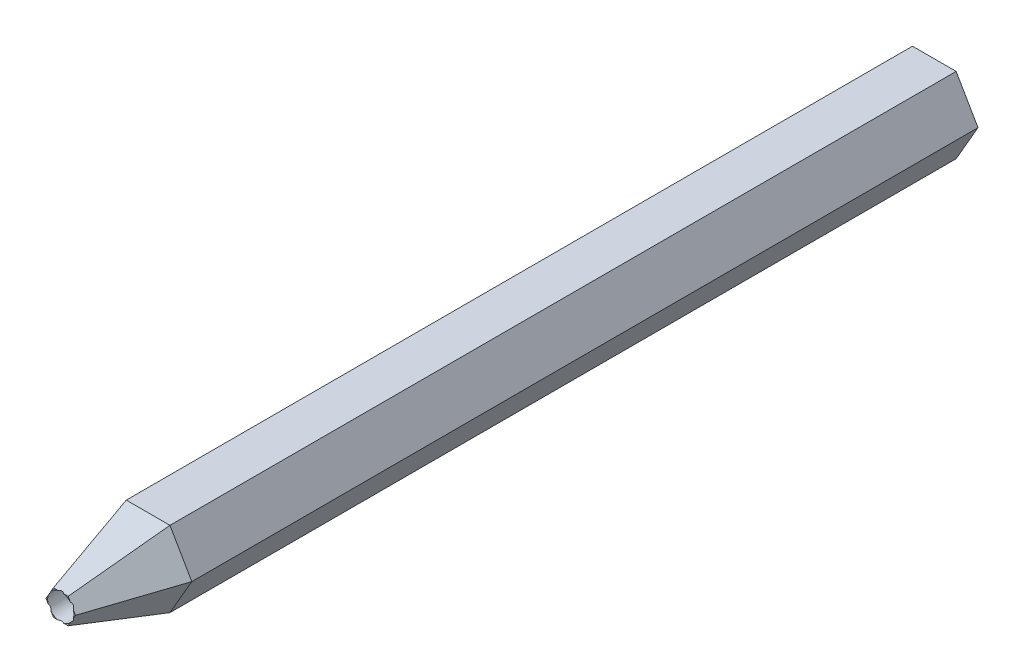
ISO-10303-21;
HEADER;
FILE_DESCRIPTION(('STEP AP214'),'2;1');
FILE_NAME('part.step','',(''),(''),'','','');
FILE_SCHEMA(('AUTOMOTIVE_DESIGN { 1 0 10303 214 1 1 1 1 }'));
ENDSEC;
DATA;
#1=APPLICATION_CONTEXT('core data for automotive mechanical design processes');
#2=APPLICATION_PROTOCOL_DEFINITION('international standard','automotive_design',2000,#1);
#3=PRODUCT_CONTEXT('',#1,'mechanical');
#4=PRODUCT('Part','Part','',(#3));
#5=PRODUCT_RELATED_PRODUCT_CATEGORY('part','',(#4));
#6=PRODUCT_DEFINITION_FORMATION('','',#4);
#7=PRODUCT_DEFINITION_CONTEXT('part definition',#1,'design');
#8=PRODUCT_DEFINITION('design','',#6,#7);
#9=PRODUCT_DEFINITION_SHAPE('','',#8);
#10=(LENGTH_UNIT() NAMED_UNIT(*) SI_UNIT(.MILLI.,.METRE.));
#11=(NAMED_UNIT(*) PLANE_ANGLE_UNIT() SI_UNIT($,.RADIAN.));
#12=(NAMED_UNIT(*) SI_UNIT($,.STERADIAN.) SOLID_ANGLE_UNIT());
#13=UNCERTAINTY_MEASURE_WITH_UNIT(LENGTH_MEASURE(1.E-05),#10,'distance_accuracy_value','');
#14=(GEOMETRIC_REPRESENTATION_CONTEXT(3) GLOBAL_UNCERTAINTY_ASSIGNED_CONTEXT((#13)) GLOBAL_UNIT_ASSIGNED_CONTEXT((#10,
#11,#12)) REPRESENTATION_CONTEXT('',''));
#15=CARTESIAN_POINT('',(0.,0.,0.));
#16=DIRECTION('',(0.,0.,1.));
#17=DIRECTION('',(1.,0.,0.));
#18=AXIS2_PLACEMENT_3D('',#15,#16,#17);
#19=CARTESIAN_POINT('',(7.49999999999999,-4.33012701892219,100.));
#20=DIRECTION('',(0.,0.,1.));
#21=DIRECTION('',(1.,0.,0.));
#22=AXIS2_PLACEMENT_3D('',#19,#20,#21);
#23=PLANE('',#22);
#24=CARTESIAN_POINT('',(0.,0.,100.));
#25=DIRECTION('',(0.,0.,1.));
#26=DIRECTION('',(1.,0.,0.));
#27=AXIS2_PLACEMENT_3D('',#24,#25,#26);
#28=CIRCLE('',#27,1.5);
#29=CARTESIAN_POINT('',(1.10043882872506,1.01933036069482,100.));
#30=VERTEX_POINT('',#29);
#31=CARTESIAN_POINT('',(0.33254657284792,1.4626731613341,100.));
#32=VERTEX_POINT('',#31);
#33=EDGE_CURVE('E149',#30,#32,#28,.T.);
#34=ORIENTED_EDGE('',*,*,#33,.F.);
#35=DIRECTION('',(-0.5,0.866025403784439,0.));
#36=VECTOR('',#35,1.);
#37=CARTESIAN_POINT('',(0.0167121151490251,2.89640009012815,100.));
#38=LINE('',#37,#36);
#39=CARTESIAN_POINT('',(0.844474743432681,1.46267316133411,100.));
#40=VERTEX_POINT('',#39);
#41=EDGE_CURVE('E158',#30,#40,#38,.T.);
#42=ORIENTED_EDGE('',*,*,#41,.T.);
#43=DIRECTION('',(-1.,0.,0.));
#44=VECTOR('',#43,1.);
#45=CARTESIAN_POINT('',(-2.5,1.4626731613341,100.));
#46=LINE('',#45,#44);
#47=EDGE_CURVE('E166',#40,#32,#46,.T.);
#48=ORIENTED_EDGE('',*,*,#47,.T.);
#49=EDGE_LOOP('',(#34,#42,#48));
#50=FACE_BOUND('',#49,.T.);
#51=ADVANCED_FACE('F31',(#50),#23,.T.);
#52=CARTESIAN_POINT('',(-0.332546572847921,1.4626731613341,100.));
#53=VERTEX_POINT('',#52);
#54=CARTESIAN_POINT('',(-1.10043882872507,1.0193303606948,100.));
#55=VERTEX_POINT('',#54);
#56=EDGE_CURVE('E280',#53,#55,#28,.T.);
#57=ORIENTED_EDGE('',*,*,#56,.F.);
#58=CARTESIAN_POINT('',(-0.844474743432688,1.4626731613341,100.));
#59=VERTEX_POINT('',#58);
#60=EDGE_CURVE('E164',#53,#59,#46,.T.);
#61=ORIENTED_EDGE('',*,*,#60,.T.);
#62=DIRECTION('',(-0.5,-0.866025403784439,0.));
#63=VECTOR('',#62,1.);
#64=CARTESIAN_POINT('',(-2.51671211514903,-1.43372692879404,100.));
#65=LINE('',#64,#63);
#66=EDGE_CURVE('E174',#59,#55,#65,.T.);
#67=ORIENTED_EDGE('',*,*,#66,.T.);
#68=EDGE_LOOP('',(#57,#61,#67));
#69=FACE_BOUND('',#68,.T.);
#70=ADVANCED_FACE('F323',(#69),#23,.T.);
#71=CARTESIAN_POINT('',(-1.43298540157299,0.443342800639305,100.));
#72=VERTEX_POINT('',#71);
#73=CARTESIAN_POINT('',(-1.43298540157299,-0.443342800639308,100.));
#74=VERTEX_POINT('',#73);
#75=EDGE_CURVE('E45',#72,#74,#28,.T.);
#76=ORIENTED_EDGE('',*,*,#75,.F.);
#77=CARTESIAN_POINT('',(-1.68894948686537,0.,100.));
#78=VERTEX_POINT('',#77);
#79=EDGE_CURVE('E173',#72,#78,#65,.T.);
#80=ORIENTED_EDGE('',*,*,#79,.T.);
#81=DIRECTION('',(0.5,-0.866025403784439,0.));
#82=VECTOR('',#81,1.);
#83=CARTESIAN_POINT('',(-0.0167121151490314,-2.89640009012815,100.));
#84=LINE('',#83,#82);
#85=EDGE_CURVE('E178',#78,#74,#84,.T.);
#86=ORIENTED_EDGE('',*,*,#85,.T.);
#87=EDGE_LOOP('',(#76,#80,#86));
#88=FACE_BOUND('',#87,.T.);
#89=ADVANCED_FACE('F287',(#88),#23,.T.);
#90=CARTESIAN_POINT('',(-1.10043882872507,-1.0193303606948,100.));
#91=VERTEX_POINT('',#90);
#92=CARTESIAN_POINT('',(-0.332546572847922,-1.4626731613341,100.));
#93=VERTEX_POINT('',#92);
#94=EDGE_CURVE('E284',#91,#93,#28,.T.);
#95=ORIENTED_EDGE('',*,*,#94,.F.);
#96=CARTESIAN_POINT('',(-0.844474743432688,-1.4626731613341,100.));
#97=VERTEX_POINT('',#96);
#98=EDGE_CURVE('E177',#91,#97,#84,.T.);
#99=ORIENTED_EDGE('',*,*,#98,.T.);
#100=DIRECTION('',(1.,0.,0.));
#101=VECTOR('',#100,1.);
#102=CARTESIAN_POINT('',(2.5,-1.4626731613341,100.));
#103=LINE('',#102,#101);
#104=EDGE_CURVE('E222',#97,#93,#103,.T.);
#105=ORIENTED_EDGE('',*,*,#104,.T.);
#106=EDGE_LOOP('',(#95,#99,#105));
#107=FACE_BOUND('',#106,.T.);
#108=ADVANCED_FACE('F285',(#107),#23,.T.);
#109=CARTESIAN_POINT('',(0.332546572847923,-1.4626731613341,100.));
#110=VERTEX_POINT('',#109);
#111=CARTESIAN_POINT('',(1.10043882872507,-1.01933036069481,100.));
#112=VERTEX_POINT('',#111);
#113=EDGE_CURVE('E147',#110,#112,#28,.T.);
#114=ORIENTED_EDGE('',*,*,#113,.F.);
#115=CARTESIAN_POINT('',(0.844474743432685,-1.4626731613341,100.));
#116=VERTEX_POINT('',#115);
#117=EDGE_CURVE('E259',#110,#116,#103,.T.);
#118=ORIENTED_EDGE('',*,*,#117,.T.);
#119=DIRECTION('',(0.5,0.866025403784439,0.));
#120=VECTOR('',#119,1.);
#121=CARTESIAN_POINT('',(2.51671211514902,1.43372692879404,100.));
#122=LINE('',#121,#120);
#123=EDGE_CURVE('E168',#116,#112,#122,.T.);
#124=ORIENTED_EDGE('',*,*,#123,.T.);
#125=EDGE_LOOP('',(#114,#118,#124));
#126=FACE_BOUND('',#125,.T.);
#127=ADVANCED_FACE('F267',(#126),#23,.T.);
#128=CARTESIAN_POINT('',(-2.5,-4.33012701892219,100.));
#129=DIRECTION('',(0.,1.,0.));
#130=DIRECTION('',(-1.,0.,0.));
#131=AXIS2_PLACEMENT_3D('',#128,#129,#130);
#132=PLANE('',#131);
#133=DIRECTION('',(0.,0.,-1.));
#134=VECTOR('',#133,1.);
#135=CARTESIAN_POINT('',(2.5,-4.33012701892219,100.));
#136=LINE('',#135,#134);
#137=CARTESIAN_POINT('',(2.5,-4.33012701892219,89.9999999999999));
#138=VERTEX_POINT('',#137);
#139=CARTESIAN_POINT('',(2.5,-4.33012701892219,0.));
#140=VERTEX_POINT('',#139);
#141=EDGE_CURVE('E196',#138,#140,#136,.T.);
#142=ORIENTED_EDGE('',*,*,#141,.F.);
#143=DIRECTION('',(-1.,0.,0.));
#144=VECTOR('',#143,1.);
#145=CARTESIAN_POINT('',(-2.5,-4.33012701892219,89.9999999999999));
#146=LINE('',#145,#144);
#147=CARTESIAN_POINT('',(-2.5,-4.33012701892219,89.9999999999999));
#148=VERTEX_POINT('',#147);
#149=EDGE_CURVE('E39',#138,#148,#146,.T.);
#150=ORIENTED_EDGE('',*,*,#149,.T.);
#151=DIRECTION('',(0.,0.,-1.));
#152=VECTOR('',#151,1.);
#153=CARTESIAN_POINT('',(-2.5,-4.33012701892219,100.));
#154=LINE('',#153,#152);
#155=CARTESIAN_POINT('',(-2.5,-4.33012701892219,0.));
#156=VERTEX_POINT('',#155);
#157=EDGE_CURVE('E194',#148,#156,#154,.T.);
#158=ORIENTED_EDGE('',*,*,#157,.T.);
#159=DIRECTION('',(1.,0.,0.));
#160=VECTOR('',#159,1.);
#161=CARTESIAN_POINT('',(-2.5,-4.33012701892219,0.));
#162=LINE('',#161,#160);
#163=EDGE_CURVE('E237',#156,#140,#162,.T.);
#164=ORIENTED_EDGE('',*,*,#163,.T.);
#165=EDGE_LOOP('',(#142,#150,#158,#164));
#166=FACE_BOUND('',#165,.T.);
#167=ADVANCED_FACE('F33',(#166),#132,.F.);
#168=CARTESIAN_POINT('',(2.5,-4.33012701892219,100.));
#169=DIRECTION('',(-0.866025403784439,0.5,0.));
#170=DIRECTION('',(-0.5,-0.866025403784439,0.));
#171=AXIS2_PLACEMENT_3D('',#168,#169,#170);
#172=PLANE('',#171);
#173=DIRECTION('',(0.,0.,-1.));
#174=VECTOR('',#173,1.);
#175=CARTESIAN_POINT('',(5.,0.,100.));
#176=LINE('',#175,#174);
#177=CARTESIAN_POINT('',(5.,0.,89.9999999999999));
#178=VERTEX_POINT('',#177);
#179=CARTESIAN_POINT('',(5.,0.,0.));
#180=VERTEX_POINT('',#179);
#181=EDGE_CURVE('E257',#178,#180,#176,.T.);
#182=ORIENTED_EDGE('',*,*,#181,.F.);
#183=DIRECTION('',(-0.5,-0.866025403784439,0.));
#184=VECTOR('',#183,1.);
#185=CARTESIAN_POINT('',(2.5,-4.33012701892219,89.9999999999999));
#186=LINE('',#185,#184);
#187=EDGE_CURVE('E53',#178,#138,#186,.T.);
#188=ORIENTED_EDGE('',*,*,#187,.T.);
#189=ORIENTED_EDGE('',*,*,#141,.T.);
#190=DIRECTION('',(0.5,0.866025403784439,0.));
#191=VECTOR('',#190,1.);
#192=CARTESIAN_POINT('',(2.5,-4.33012701892219,0.));
#193=LINE('',#192,#191);
#194=EDGE_CURVE('E239',#140,#180,#193,.T.);
#195=ORIENTED_EDGE('',*,*,#194,.T.);
#196=EDGE_LOOP('',(#182,#188,#189,#195));
#197=FACE_BOUND('',#196,.T.);
#198=ADVANCED_FACE('F309',(#197),#172,.F.);
#199=CARTESIAN_POINT('',(5.,0.,100.));
#200=DIRECTION('',(-0.866025403784439,-0.5,0.));
#201=DIRECTION('',(0.5,-0.866025403784439,0.));
#202=AXIS2_PLACEMENT_3D('',#199,#200,#201);
#203=PLANE('',#202);
#204=DIRECTION('',(0.,0.,-1.));
#205=VECTOR('',#204,1.);
#206=CARTESIAN_POINT('',(2.5,4.33012701892219,100.));
#207=LINE('',#206,#205);
#208=CARTESIAN_POINT('',(2.5,4.33012701892219,89.9999999999999));
#209=VERTEX_POINT('',#208);
#210=CARTESIAN_POINT('',(2.5,4.33012701892219,0.));
#211=VERTEX_POINT('',#210);
#212=EDGE_CURVE('E255',#209,#211,#207,.T.);
#213=ORIENTED_EDGE('',*,*,#212,.F.);
#214=DIRECTION('',(0.5,-0.866025403784439,0.));
#215=VECTOR('',#214,1.);
#216=CARTESIAN_POINT('',(5.,0.,89.9999999999999));
#217=LINE('',#216,#215);
#218=EDGE_CURVE('E188',#209,#178,#217,.T.);
#219=ORIENTED_EDGE('',*,*,#218,.T.);
#220=ORIENTED_EDGE('',*,*,#181,.T.);
#221=DIRECTION('',(-0.5,0.866025403784439,0.));
#222=VECTOR('',#221,1.);
#223=CARTESIAN_POINT('',(5.,0.,0.));
#224=LINE('',#223,#222);
#225=EDGE_CURVE('E242',#180,#211,#224,.T.);
#226=ORIENTED_EDGE('',*,*,#225,.T.);
#227=EDGE_LOOP('',(#213,#219,#220,#226));
#228=FACE_BOUND('',#227,.T.);
#229=ADVANCED_FACE('F308',(#228),#203,.F.);
#230=CARTESIAN_POINT('',(2.5,4.33012701892219,100.));
#231=DIRECTION('',(0.,-1.,0.));
#232=DIRECTION('',(1.,0.,0.));
#233=AXIS2_PLACEMENT_3D('',#230,#231,#232);
#234=PLANE('',#233);
#235=DIRECTION('',(0.,0.,-1.));
#236=VECTOR('',#235,1.);
#237=CARTESIAN_POINT('',(-2.5,4.33012701892219,100.));
#238=LINE('',#237,#236);
#239=CARTESIAN_POINT('',(-2.5,4.33012701892219,89.9999999999999));
#240=VERTEX_POINT('',#239);
#241=CARTESIAN_POINT('',(-2.5,4.33012701892219,0.));
#242=VERTEX_POINT('',#241);
#243=EDGE_CURVE('E253',#240,#242,#238,.T.);
#244=ORIENTED_EDGE('',*,*,#243,.F.);
#245=DIRECTION('',(1.,0.,0.));
#246=VECTOR('',#245,1.);
#247=CARTESIAN_POINT('',(2.5,4.33012701892219,89.9999999999999));
#248=LINE('',#247,#246);
#249=EDGE_CURVE('E186',#240,#209,#248,.T.);
#250=ORIENTED_EDGE('',*,*,#249,.T.);
#251=ORIENTED_EDGE('',*,*,#212,.T.);
#252=DIRECTION('',(-1.,0.,0.));
#253=VECTOR('',#252,1.);
#254=CARTESIAN_POINT('',(2.5,4.33012701892219,0.));
#255=LINE('',#254,#253);
#256=EDGE_CURVE('E245',#211,#242,#255,.T.);
#257=ORIENTED_EDGE('',*,*,#256,.T.);
#258=EDGE_LOOP('',(#244,#250,#251,#257));
#259=FACE_BOUND('',#258,.T.);
#260=ADVANCED_FACE('F298',(#259),#234,.F.);
#261=CARTESIAN_POINT('',(-2.5,4.33012701892219,100.));
#262=DIRECTION('',(0.866025403784439,-0.5,0.));
#263=DIRECTION('',(0.5,0.866025403784439,0.));
#264=AXIS2_PLACEMENT_3D('',#261,#262,#263);
#265=PLANE('',#264);
#266=DIRECTION('',(0.,0.,-1.));
#267=VECTOR('',#266,1.);
#268=CARTESIAN_POINT('',(-5.,0.,100.));
#269=LINE('',#268,#267);
#270=CARTESIAN_POINT('',(-5.,0.,89.9999999999999));
#271=VERTEX_POINT('',#270);
#272=CARTESIAN_POINT('',(-5.,0.,0.));
#273=VERTEX_POINT('',#272);
#274=EDGE_CURVE('E208',#271,#273,#269,.T.);
#275=ORIENTED_EDGE('',*,*,#274,.F.);
#276=DIRECTION('',(0.5,0.866025403784439,0.));
#277=VECTOR('',#276,1.);
#278=CARTESIAN_POINT('',(-2.5,4.33012701892219,89.9999999999999));
#279=LINE('',#278,#277);
#280=EDGE_CURVE('E184',#271,#240,#279,.T.);
#281=ORIENTED_EDGE('',*,*,#280,.T.);
#282=ORIENTED_EDGE('',*,*,#243,.T.);
#283=DIRECTION('',(-0.5,-0.866025403784439,0.));
#284=VECTOR('',#283,1.);
#285=CARTESIAN_POINT('',(-2.5,4.33012701892219,0.));
#286=LINE('',#285,#284);
#287=EDGE_CURVE('E248',#242,#273,#286,.T.);
#288=ORIENTED_EDGE('',*,*,#287,.T.);
#289=EDGE_LOOP('',(#275,#281,#282,#288));
#290=FACE_BOUND('',#289,.T.);
#291=ADVANCED_FACE('F295',(#290),#265,.F.);
#292=CARTESIAN_POINT('',(-5.,0.,100.));
#293=DIRECTION('',(0.866025403784439,0.5,0.));
#294=DIRECTION('',(-0.5,0.866025403784439,0.));
#295=AXIS2_PLACEMENT_3D('',#292,#293,#294);
#296=PLANE('',#295);
#297=ORIENTED_EDGE('',*,*,#157,.F.);
#298=DIRECTION('',(-0.5,0.866025403784439,0.));
#299=VECTOR('',#298,1.);
#300=CARTESIAN_POINT('',(-5.,0.,89.9999999999999));
#301=LINE('',#300,#299);
#302=EDGE_CURVE('E181',#148,#271,#301,.T.);
#303=ORIENTED_EDGE('',*,*,#302,.T.);
#304=ORIENTED_EDGE('',*,*,#274,.T.);
#305=DIRECTION('',(0.5,-0.866025403784439,0.));
#306=VECTOR('',#305,1.);
#307=CARTESIAN_POINT('',(-5.,0.,0.));
#308=LINE('',#307,#306);
#309=EDGE_CURVE('E206',#273,#156,#308,.T.);
#310=ORIENTED_EDGE('',*,*,#309,.T.);
#311=EDGE_LOOP('',(#297,#303,#304,#310));
#312=FACE_BOUND('',#311,.T.);
#313=ADVANCED_FACE('F203',(#312),#296,.F.);
#314=CARTESIAN_POINT('',(1.43298540157299,-0.443342800639294,100.));
#315=VERTEX_POINT('',#314);
#316=CARTESIAN_POINT('',(1.432985401573,0.443342800639283,100.));
#317=VERTEX_POINT('',#316);
#318=EDGE_CURVE('E136',#315,#317,#28,.T.);
#319=ORIENTED_EDGE('',*,*,#318,.F.);
#320=CARTESIAN_POINT('',(1.68894948686537,0.,100.));
#321=VERTEX_POINT('',#320);
#322=EDGE_CURVE('E163',#315,#321,#122,.T.);
#323=ORIENTED_EDGE('',*,*,#322,.T.);
#324=EDGE_CURVE('E155',#321,#317,#38,.T.);
#325=ORIENTED_EDGE('',*,*,#324,.T.);
#326=EDGE_LOOP('',(#319,#323,#325));
#327=FACE_BOUND('',#326,.T.);
#328=ADVANCED_FACE('F162',(#327),#23,.T.);
#329=CARTESIAN_POINT('',(7.49999999999999,-4.33012701892219,0.));
#330=DIRECTION('',(0.,0.,1.));
#331=DIRECTION('',(1.,0.,0.));
#332=AXIS2_PLACEMENT_3D('',#329,#330,#331);
#333=PLANE('',#332);
#334=CARTESIAN_POINT('',(0.,0.,0.));
#335=DIRECTION('',(0.,0.,1.));
#336=DIRECTION('',(1.,0.,0.));
#337=AXIS2_PLACEMENT_3D('',#334,#335,#336);
#338=CIRCLE('',#337,1.5);
#339=CARTESIAN_POINT('',(1.5,0.,0.));
#340=VERTEX_POINT('',#339);
#341=EDGE_CURVE('E276',#340,#340,#338,.T.);
#342=ORIENTED_EDGE('',*,*,#341,.T.);
#343=EDGE_LOOP('',(#342));
#344=FACE_BOUND('',#343,.T.);
#345=ORIENTED_EDGE('',*,*,#163,.F.);
#346=ORIENTED_EDGE('',*,*,#309,.F.);
#347=ORIENTED_EDGE('',*,*,#287,.F.);
#348=ORIENTED_EDGE('',*,*,#256,.F.);
#349=ORIENTED_EDGE('',*,*,#225,.F.);
#350=ORIENTED_EDGE('',*,*,#194,.F.);
#351=EDGE_LOOP('',(#345,#346,#347,#348,#349,#350));
#352=FACE_BOUND('',#351,.T.);
#353=ADVANCED_FACE('F313',(#344,#352),#333,.F.);
#354=CARTESIAN_POINT('',(5.01671211514902,-5.76385394771623,100.));
#355=DIRECTION('',(0.832477048367497,0.48063084796916,0.275637355816996));
#356=DIRECTION('',(-0.5,0.866025403784438,0.));
#357=AXIS2_PLACEMENT_3D('',#354,#355,#356);
#358=PLANE('',#357);
#359=CARTESIAN_POINT('',(0.,0.,105.100947509455));
#360=DIRECTION('',(0.832477048367497,0.48063084796916,0.275637355816996));
#361=DIRECTION('',(-0.238708952369489,-0.137818677908498,0.96126169593832));
#362=AXIS2_PLACEMENT_3D('',#359,#360,#361);
#363=ELLIPSE('',#362,5.441932917815,1.5);
#364=EDGE_CURVE('E140',#317,#30,#363,.T.);
#365=ORIENTED_EDGE('',*,*,#364,.F.);
#366=ORIENTED_EDGE('',*,*,#324,.F.);
#367=DIRECTION('',(-0.314323319879851,0.,0.949315990900664));
#368=VECTOR('',#367,1.);
#369=CARTESIAN_POINT('',(1.64723279368634,0.,100.125992318793));
#370=LINE('',#369,#368);
#371=EDGE_CURVE('E232',#178,#321,#370,.T.);
#372=ORIENTED_EDGE('',*,*,#371,.F.);
#373=ORIENTED_EDGE('',*,*,#218,.F.);
#374=DIRECTION('',(-0.157161659939925,-0.272211980017813,0.949315990900664));
#375=VECTOR('',#374,1.);
#376=CARTESIAN_POINT('',(0.638367991680118,1.10568579551568,101.244962895824));
#377=LINE('',#376,#375);
#378=EDGE_CURVE('E234',#40,#209,#377,.F.);
#379=ORIENTED_EDGE('',*,*,#378,.F.);
#380=ORIENTED_EDGE('',*,*,#41,.F.);
#381=EDGE_LOOP('',(#365,#366,#372,#373,#379,#380));
#382=FACE_BOUND('',#381,.T.);
#383=ADVANCED_FACE('F153',(#382),#358,.T.);
#384=CARTESIAN_POINT('',(7.49999999999999,1.46267316133411,100.));
#385=DIRECTION('',(0.,0.96126169593832,0.275637355816996));
#386=DIRECTION('',(0.,-0.275637355816996,0.96126169593832));
#387=AXIS2_PLACEMENT_3D('',#384,#385,#386);
#388=PLANE('',#387);
#389=CARTESIAN_POINT('',(0.,0.,105.100947509455));
#390=DIRECTION('',(0.,0.96126169593832,0.275637355816996));
#391=DIRECTION('',(0.,-0.275637355816996,0.96126169593832));
#392=AXIS2_PLACEMENT_3D('',#389,#390,#391);
#393=ELLIPSE('',#392,5.44193291781501,1.5);
#394=EDGE_CURVE('E160',#32,#53,#393,.T.);
#395=ORIENTED_EDGE('',*,*,#394,.F.);
#396=ORIENTED_EDGE('',*,*,#47,.F.);
#397=ORIENTED_EDGE('',*,*,#378,.T.);
#398=ORIENTED_EDGE('',*,*,#249,.F.);
#399=DIRECTION('',(0.157161659939925,-0.272211980017813,0.949315990900664));
#400=VECTOR('',#399,1.);
#401=CARTESIAN_POINT('',(-0.638367991680126,1.10568579551568,101.244962895824));
#402=LINE('',#401,#400);
#403=EDGE_CURVE('E229',#59,#240,#402,.F.);
#404=ORIENTED_EDGE('',*,*,#403,.F.);
#405=ORIENTED_EDGE('',*,*,#60,.F.);
#406=EDGE_LOOP('',(#395,#396,#397,#398,#404,#405));
#407=FACE_BOUND('',#406,.T.);
#408=ADVANCED_FACE('F303',(#407),#388,.T.);
#409=CARTESIAN_POINT('',(1.26671211514903,-0.731336580667053,100.));
#410=DIRECTION('',(0.832477048367498,-0.48063084796916,0.275637355816997));
#411=DIRECTION('',(0.5,0.866025403784439,0.));
#412=AXIS2_PLACEMENT_3D('',#409,#410,#411);
#413=PLANE('',#412);
#414=CARTESIAN_POINT('',(0.,0.,105.100947509455));
#415=DIRECTION('',(0.832477048367498,-0.48063084796916,0.275637355816997));
#416=DIRECTION('',(-0.23870895236949,0.137818677908498,0.96126169593832));
#417=AXIS2_PLACEMENT_3D('',#414,#415,#416);
#418=ELLIPSE('',#417,5.441932917815,1.5);
#419=EDGE_CURVE('E143',#112,#315,#418,.T.);
#420=ORIENTED_EDGE('',*,*,#419,.F.);
#421=ORIENTED_EDGE('',*,*,#123,.F.);
#422=DIRECTION('',(-0.157161659939926,0.272211980017813,0.949315990900664));
#423=VECTOR('',#422,1.);
#424=CARTESIAN_POINT('',(1.00886480200621,-1.74740509504268,99.007021741762));
#425=LINE('',#424,#423);
#426=EDGE_CURVE('E224',#138,#116,#425,.T.);
#427=ORIENTED_EDGE('',*,*,#426,.F.);
#428=ORIENTED_EDGE('',*,*,#187,.F.);
#429=ORIENTED_EDGE('',*,*,#371,.T.);
#430=ORIENTED_EDGE('',*,*,#322,.F.);
#431=EDGE_LOOP('',(#420,#421,#427,#428,#429,#430));
#432=FACE_BOUND('',#431,.T.);
#433=ADVANCED_FACE('F269',(#432),#413,.T.);
#434=CARTESIAN_POINT('',(-1.26671211514903,0.731336580667056,100.));
#435=DIRECTION('',(-0.832477048367497,0.48063084796916,0.275637355816996));
#436=DIRECTION('',(-0.5,-0.866025403784438,0.));
#437=AXIS2_PLACEMENT_3D('',#434,#435,#436);
#438=PLANE('',#437);
#439=CARTESIAN_POINT('',(0.,0.,105.100947509455));
#440=DIRECTION('',(-0.832477048367497,0.48063084796916,0.275637355816996));
#441=DIRECTION('',(0.238708952369489,-0.137818677908498,0.96126169593832));
#442=AXIS2_PLACEMENT_3D('',#439,#440,#441);
#443=ELLIPSE('',#442,5.44193291781501,1.5);
#444=EDGE_CURVE('E270',#55,#72,#443,.T.);
#445=ORIENTED_EDGE('',*,*,#444,.F.);
#446=ORIENTED_EDGE('',*,*,#66,.F.);
#447=ORIENTED_EDGE('',*,*,#403,.T.);
#448=ORIENTED_EDGE('',*,*,#280,.F.);
#449=DIRECTION('',(0.314323319879851,0.,0.949315990900664));
#450=VECTOR('',#449,1.);
#451=CARTESIAN_POINT('',(-1.64723279368634,0.,100.125992318793));
#452=LINE('',#451,#450);
#453=EDGE_CURVE('E217',#78,#271,#452,.F.);
#454=ORIENTED_EDGE('',*,*,#453,.F.);
#455=ORIENTED_EDGE('',*,*,#79,.F.);
#456=EDGE_LOOP('',(#445,#446,#447,#448,#454,#455));
#457=FACE_BOUND('',#456,.T.);
#458=ADVANCED_FACE('F290',(#457),#438,.T.);
#459=CARTESIAN_POINT('',(7.49999999999999,-1.4626731613341,100.));
#460=DIRECTION('',(0.,-0.96126169593832,0.275637355816996));
#461=DIRECTION('',(0.,-0.275637355816996,-0.96126169593832));
#462=AXIS2_PLACEMENT_3D('',#459,#460,#461);
#463=PLANE('',#462);
#464=CARTESIAN_POINT('',(0.,0.,105.100947509455));
#465=DIRECTION('',(0.,-0.96126169593832,0.275637355816996));
#466=DIRECTION('',(0.,0.275637355816996,0.96126169593832));
#467=AXIS2_PLACEMENT_3D('',#464,#465,#466);
#468=ELLIPSE('',#467,5.44193291781501,1.5);
#469=EDGE_CURVE('E272',#93,#110,#468,.T.);
#470=ORIENTED_EDGE('',*,*,#469,.F.);
#471=ORIENTED_EDGE('',*,*,#104,.F.);
#472=DIRECTION('',(-0.157161659939925,-0.272211980017813,-0.949315990900664));
#473=VECTOR('',#472,1.);
#474=CARTESIAN_POINT('',(-0.638367991680126,-1.10568579551568,101.244962895824));
#475=LINE('',#474,#473);
#476=EDGE_CURVE('E159',#148,#97,#475,.F.);
#477=ORIENTED_EDGE('',*,*,#476,.F.);
#478=ORIENTED_EDGE('',*,*,#149,.F.);
#479=ORIENTED_EDGE('',*,*,#426,.T.);
#480=ORIENTED_EDGE('',*,*,#117,.F.);
#481=EDGE_LOOP('',(#470,#471,#477,#478,#479,#480));
#482=FACE_BOUND('',#481,.T.);
#483=ADVANCED_FACE('F220',(#482),#463,.T.);
#484=CARTESIAN_POINT('',(2.48328788485097,-7.22652710905033,100.));
#485=DIRECTION('',(-0.832477048367497,-0.48063084796916,0.275637355816996));
#486=DIRECTION('',(0.5,-0.866025403784438,0.));
#487=AXIS2_PLACEMENT_3D('',#484,#485,#486);
#488=PLANE('',#487);
#489=CARTESIAN_POINT('',(0.,0.,105.100947509455));
#490=DIRECTION('',(-0.832477048367497,-0.48063084796916,0.275637355816996));
#491=DIRECTION('',(0.238708952369489,0.137818677908498,0.96126169593832));
#492=AXIS2_PLACEMENT_3D('',#489,#490,#491);
#493=ELLIPSE('',#492,5.44193291781501,1.5);
#494=EDGE_CURVE('E11',#74,#91,#493,.T.);
#495=ORIENTED_EDGE('',*,*,#494,.F.);
#496=ORIENTED_EDGE('',*,*,#85,.F.);
#497=ORIENTED_EDGE('',*,*,#453,.T.);
#498=ORIENTED_EDGE('',*,*,#302,.F.);
#499=ORIENTED_EDGE('',*,*,#476,.T.);
#500=ORIENTED_EDGE('',*,*,#98,.F.);
#501=EDGE_LOOP('',(#495,#496,#497,#498,#499,#500));
#502=FACE_BOUND('',#501,.T.);
#503=ADVANCED_FACE('F212',(#502),#488,.T.);
#504=CARTESIAN_POINT('',(0.,0.,0.));
#505=DIRECTION('',(0.,0.,1.));
#506=DIRECTION('',(1.,0.,0.));
#507=AXIS2_PLACEMENT_3D('',#504,#505,#506);
#508=CYLINDRICAL_SURFACE('',#507,1.5);
#509=ORIENTED_EDGE('',*,*,#364,.T.);
#510=ORIENTED_EDGE('',*,*,#33,.T.);
#511=ORIENTED_EDGE('',*,*,#394,.T.);
#512=ORIENTED_EDGE('',*,*,#56,.T.);
#513=ORIENTED_EDGE('',*,*,#444,.T.);
#514=ORIENTED_EDGE('',*,*,#75,.T.);
#515=ORIENTED_EDGE('',*,*,#494,.T.);
#516=ORIENTED_EDGE('',*,*,#94,.T.);
#517=ORIENTED_EDGE('',*,*,#469,.T.);
#518=ORIENTED_EDGE('',*,*,#113,.T.);
#519=ORIENTED_EDGE('',*,*,#419,.T.);
#520=ORIENTED_EDGE('',*,*,#318,.T.);
#521=EDGE_LOOP('',(#509,#510,#511,#512,#513,#514,#515,#516,#517,#518,#519,#520));
#522=FACE_BOUND('',#521,.T.);
#523=ORIENTED_EDGE('',*,*,#341,.F.);
#524=EDGE_LOOP('',(#523));
#525=FACE_BOUND('',#524,.T.);
#526=ADVANCED_FACE('F138',(#522,#525),#508,.F.);
#527=CLOSED_SHELL('',(#51,#70,#89,#108,#127,#167,#198,#229,#260,#291,#313,#328,#353,#383,#408,
#433,#458,#483,#503,#526));
#528=MANIFOLD_SOLID_BREP('B2',#527);
#529=ADVANCED_BREP_SHAPE_REPRESENTATION('',(#18,#528),#14);
#530=SHAPE_DEFINITION_REPRESENTATION(#9,#529);
ENDSEC;
END-ISO-10303-21;
